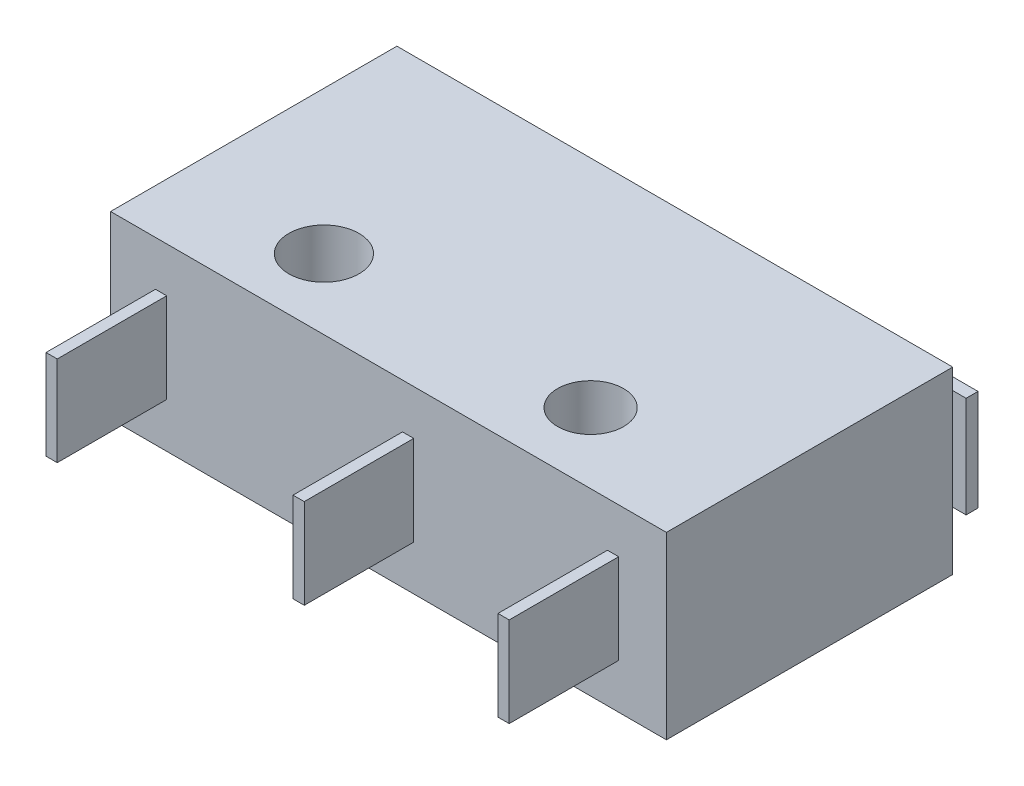
ISO-10303-21;
HEADER;
FILE_DESCRIPTION(('STEP AP214'),'2;1');
FILE_NAME('part.step','',(''),(''),'','','');
FILE_SCHEMA(('AUTOMOTIVE_DESIGN { 1 0 10303 214 1 1 1 1 }'));
ENDSEC;
DATA;
#1=APPLICATION_CONTEXT('core data for automotive mechanical design processes');
#2=APPLICATION_PROTOCOL_DEFINITION('international standard','automotive_design',2000,#1);
#3=PRODUCT_CONTEXT('',#1,'mechanical');
#4=PRODUCT('Part','Part','',(#3));
#5=PRODUCT_RELATED_PRODUCT_CATEGORY('part','',(#4));
#6=PRODUCT_DEFINITION_FORMATION('','',#4);
#7=PRODUCT_DEFINITION_CONTEXT('part definition',#1,'design');
#8=PRODUCT_DEFINITION('design','',#6,#7);
#9=PRODUCT_DEFINITION_SHAPE('','',#8);
#10=(LENGTH_UNIT() NAMED_UNIT(*) SI_UNIT(.MILLI.,.METRE.));
#11=(NAMED_UNIT(*) PLANE_ANGLE_UNIT() SI_UNIT($,.RADIAN.));
#12=(NAMED_UNIT(*) SI_UNIT($,.STERADIAN.) SOLID_ANGLE_UNIT());
#13=UNCERTAINTY_MEASURE_WITH_UNIT(LENGTH_MEASURE(1.E-05),#10,'distance_accuracy_value','');
#14=(GEOMETRIC_REPRESENTATION_CONTEXT(3) GLOBAL_UNCERTAINTY_ASSIGNED_CONTEXT((#13)) GLOBAL_UNIT_ASSIGNED_CONTEXT((#10,
#11,#12)) REPRESENTATION_CONTEXT('',''));
#15=CARTESIAN_POINT('',(0.,0.,0.));
#16=DIRECTION('',(0.,0.,1.));
#17=DIRECTION('',(1.,0.,0.));
#18=AXIS2_PLACEMENT_3D('',#15,#16,#17);
#19=CARTESIAN_POINT('',(-9.9,3.2,5.1));
#20=DIRECTION('',(0.,0.,-1.));
#21=DIRECTION('',(-1.,0.,0.));
#22=AXIS2_PLACEMENT_3D('',#19,#20,#21);
#23=PLANE('',#22);
#24=DIRECTION('',(0.,1.,0.));
#25=VECTOR('',#24,1.);
#26=CARTESIAN_POINT('',(0.9,1.6,5.1));
#27=LINE('',#26,#25);
#28=CARTESIAN_POINT('',(0.9,-1.6,5.1));
#29=VERTEX_POINT('',#28);
#30=CARTESIAN_POINT('',(0.9,1.6,5.1));
#31=VERTEX_POINT('',#30);
#32=EDGE_CURVE('E243',#29,#31,#27,.T.);
#33=ORIENTED_EDGE('',*,*,#32,.F.);
#34=DIRECTION('',(1.,0.,0.));
#35=VECTOR('',#34,1.);
#36=CARTESIAN_POINT('',(0.5,-1.6,5.1));
#37=LINE('',#36,#35);
#38=CARTESIAN_POINT('',(0.5,-1.6,5.1));
#39=VERTEX_POINT('',#38);
#40=EDGE_CURVE('E248',#39,#29,#37,.T.);
#41=ORIENTED_EDGE('',*,*,#40,.F.);
#42=DIRECTION('',(0.,-1.,0.));
#43=VECTOR('',#42,1.);
#44=CARTESIAN_POINT('',(0.5,1.6,5.1));
#45=LINE('',#44,#43);
#46=CARTESIAN_POINT('',(0.5,1.6,5.1));
#47=VERTEX_POINT('',#46);
#48=EDGE_CURVE('E260',#47,#39,#45,.T.);
#49=ORIENTED_EDGE('',*,*,#48,.F.);
#50=DIRECTION('',(-1.,0.,0.));
#51=VECTOR('',#50,1.);
#52=CARTESIAN_POINT('',(0.5,1.6,5.1));
#53=LINE('',#52,#51);
#54=EDGE_CURVE('E257',#31,#47,#53,.T.);
#55=ORIENTED_EDGE('',*,*,#54,.F.);
#56=EDGE_LOOP('',(#33,#41,#49,#55));
#57=FACE_BOUND('',#56,.T.);
#58=DIRECTION('',(1.,0.,0.));
#59=VECTOR('',#58,1.);
#60=CARTESIAN_POINT('',(-9.9,-3.2,5.1));
#61=LINE('',#60,#59);
#62=CARTESIAN_POINT('',(-9.9,-3.2,5.1));
#63=VERTEX_POINT('',#62);
#64=CARTESIAN_POINT('',(9.9,-3.2,5.1));
#65=VERTEX_POINT('',#64);
#66=EDGE_CURVE('E369',#63,#65,#61,.T.);
#67=ORIENTED_EDGE('',*,*,#66,.T.);
#68=DIRECTION('',(0.,-1.,0.));
#69=VECTOR('',#68,1.);
#70=CARTESIAN_POINT('',(9.9,3.2,5.1));
#71=LINE('',#70,#69);
#72=CARTESIAN_POINT('',(9.9,3.2,5.1));
#73=VERTEX_POINT('',#72);
#74=EDGE_CURVE('E375',#73,#65,#71,.T.);
#75=ORIENTED_EDGE('',*,*,#74,.F.);
#76=DIRECTION('',(1.,0.,0.));
#77=VECTOR('',#76,1.);
#78=CARTESIAN_POINT('',(-9.9,3.2,5.1));
#79=LINE('',#78,#77);
#80=CARTESIAN_POINT('',(-9.9,3.2,5.1));
#81=VERTEX_POINT('',#80);
#82=EDGE_CURVE('E373',#81,#73,#79,.T.);
#83=ORIENTED_EDGE('',*,*,#82,.F.);
#84=DIRECTION('',(0.,-1.,0.));
#85=VECTOR('',#84,1.);
#86=CARTESIAN_POINT('',(-9.9,3.2,5.1));
#87=LINE('',#86,#85);
#88=EDGE_CURVE('E385',#81,#63,#87,.T.);
#89=ORIENTED_EDGE('',*,*,#88,.T.);
#90=EDGE_LOOP('',(#67,#75,#83,#89));
#91=FACE_BOUND('',#90,.T.);
#92=DIRECTION('',(0.,1.,0.));
#93=VECTOR('',#92,1.);
#94=CARTESIAN_POINT('',(-7.9,1.6,5.1));
#95=LINE('',#94,#93);
#96=CARTESIAN_POINT('',(-7.9,-1.6,5.1));
#97=VERTEX_POINT('',#96);
#98=CARTESIAN_POINT('',(-7.9,1.6,5.1));
#99=VERTEX_POINT('',#98);
#100=EDGE_CURVE('E276',#97,#99,#95,.T.);
#101=ORIENTED_EDGE('',*,*,#100,.F.);
#102=DIRECTION('',(1.,0.,0.));
#103=VECTOR('',#102,1.);
#104=CARTESIAN_POINT('',(-8.3,-1.6,5.1));
#105=LINE('',#104,#103);
#106=CARTESIAN_POINT('',(-8.3,-1.6,5.1));
#107=VERTEX_POINT('',#106);
#108=EDGE_CURVE('E281',#107,#97,#105,.T.);
#109=ORIENTED_EDGE('',*,*,#108,.F.);
#110=DIRECTION('',(0.,-1.,0.));
#111=VECTOR('',#110,1.);
#112=CARTESIAN_POINT('',(-8.3,1.6,5.1));
#113=LINE('',#112,#111);
#114=CARTESIAN_POINT('',(-8.3,1.6,5.1));
#115=VERTEX_POINT('',#114);
#116=EDGE_CURVE('E293',#115,#107,#113,.T.);
#117=ORIENTED_EDGE('',*,*,#116,.F.);
#118=DIRECTION('',(-1.,0.,0.));
#119=VECTOR('',#118,1.);
#120=CARTESIAN_POINT('',(-8.3,1.6,5.1));
#121=LINE('',#120,#119);
#122=EDGE_CURVE('E290',#99,#115,#121,.T.);
#123=ORIENTED_EDGE('',*,*,#122,.F.);
#124=EDGE_LOOP('',(#101,#109,#117,#123));
#125=FACE_BOUND('',#124,.T.);
#126=DIRECTION('',(0.,1.,0.));
#127=VECTOR('',#126,1.);
#128=CARTESIAN_POINT('',(8.2,1.6,5.1));
#129=LINE('',#128,#127);
#130=CARTESIAN_POINT('',(8.2,-1.6,5.1));
#131=VERTEX_POINT('',#130);
#132=CARTESIAN_POINT('',(8.2,1.6,5.1));
#133=VERTEX_POINT('',#132);
#134=EDGE_CURVE('E208',#131,#133,#129,.T.);
#135=ORIENTED_EDGE('',*,*,#134,.F.);
#136=DIRECTION('',(1.,0.,0.));
#137=VECTOR('',#136,1.);
#138=CARTESIAN_POINT('',(7.8,-1.6,5.1));
#139=LINE('',#138,#137);
#140=CARTESIAN_POINT('',(7.8,-1.6,5.1));
#141=VERTEX_POINT('',#140);
#142=EDGE_CURVE('E215',#141,#131,#139,.T.);
#143=ORIENTED_EDGE('',*,*,#142,.F.);
#144=DIRECTION('',(0.,-1.,0.));
#145=VECTOR('',#144,1.);
#146=CARTESIAN_POINT('',(7.8,1.6,5.1));
#147=LINE('',#146,#145);
#148=CARTESIAN_POINT('',(7.8,1.6,5.1));
#149=VERTEX_POINT('',#148);
#150=EDGE_CURVE('E227',#149,#141,#147,.T.);
#151=ORIENTED_EDGE('',*,*,#150,.F.);
#152=DIRECTION('',(-1.,0.,0.));
#153=VECTOR('',#152,1.);
#154=CARTESIAN_POINT('',(7.8,1.6,5.1));
#155=LINE('',#154,#153);
#156=EDGE_CURVE('E224',#133,#149,#155,.T.);
#157=ORIENTED_EDGE('',*,*,#156,.F.);
#158=EDGE_LOOP('',(#135,#143,#151,#157));
#159=FACE_BOUND('',#158,.T.);
#160=ADVANCED_FACE('F37',(#57,#91,#125,#159),#23,.F.);
#161=CARTESIAN_POINT('',(-9.9,3.2,-5.1));
#162=DIRECTION('',(0.,0.,1.));
#163=DIRECTION('',(1.,0.,0.));
#164=AXIS2_PLACEMENT_3D('',#161,#162,#163);
#165=PLANE('',#164);
#166=DIRECTION('',(0.,-1.,0.));
#167=VECTOR('',#166,1.);
#168=CARTESIAN_POINT('',(-2.80029071826333,1.7,-5.1));
#169=LINE('',#168,#167);
#170=CARTESIAN_POINT('',(-2.80029071826333,1.7,-5.1));
#171=VERTEX_POINT('',#170);
#172=CARTESIAN_POINT('',(-2.80029071826333,-1.7,-5.1));
#173=VERTEX_POINT('',#172);
#174=EDGE_CURVE('E55',#171,#173,#169,.T.);
#175=ORIENTED_EDGE('',*,*,#174,.F.);
#176=DIRECTION('',(-1.,0.,0.));
#177=VECTOR('',#176,1.);
#178=CARTESIAN_POINT('',(-9.9,1.7,-5.1));
#179=LINE('',#178,#177);
#180=CARTESIAN_POINT('',(-3.81456377409336,1.7,-5.1));
#181=VERTEX_POINT('',#180);
#182=EDGE_CURVE('E11',#171,#181,#179,.T.);
#183=ORIENTED_EDGE('',*,*,#182,.T.);
#184=DIRECTION('',(0.,-1.,0.));
#185=VECTOR('',#184,1.);
#186=CARTESIAN_POINT('',(-3.81456377409336,1.7,-5.1));
#187=LINE('',#186,#185);
#188=CARTESIAN_POINT('',(-3.81456377409336,-1.7,-5.1));
#189=VERTEX_POINT('',#188);
#190=EDGE_CURVE('E45',#189,#181,#187,.F.);
#191=ORIENTED_EDGE('',*,*,#190,.F.);
#192=DIRECTION('',(-1.,0.,0.));
#193=VECTOR('',#192,1.);
#194=CARTESIAN_POINT('',(-9.9,-1.7,-5.1));
#195=LINE('',#194,#193);
#196=EDGE_CURVE('E194',#173,#189,#195,.T.);
#197=ORIENTED_EDGE('',*,*,#196,.F.);
#198=EDGE_LOOP('',(#175,#183,#191,#197));
#199=FACE_BOUND('',#198,.T.);
#200=DIRECTION('',(-1.,0.,0.));
#201=VECTOR('',#200,1.);
#202=CARTESIAN_POINT('',(-9.9,-3.2,-5.1));
#203=LINE('',#202,#201);
#204=CARTESIAN_POINT('',(9.9,-3.2,-5.1));
#205=VERTEX_POINT('',#204);
#206=CARTESIAN_POINT('',(-9.9,-3.2,-5.1));
#207=VERTEX_POINT('',#206);
#208=EDGE_CURVE('E378',#205,#207,#203,.T.);
#209=ORIENTED_EDGE('',*,*,#208,.T.);
#210=DIRECTION('',(0.,-1.,0.));
#211=VECTOR('',#210,1.);
#212=CARTESIAN_POINT('',(-9.9,3.2,-5.1));
#213=LINE('',#212,#211);
#214=CARTESIAN_POINT('',(-9.9,3.2,-5.1));
#215=VERTEX_POINT('',#214);
#216=EDGE_CURVE('E388',#215,#207,#213,.T.);
#217=ORIENTED_EDGE('',*,*,#216,.F.);
#218=DIRECTION('',(-1.,0.,0.));
#219=VECTOR('',#218,1.);
#220=CARTESIAN_POINT('',(-9.9,3.2,-5.1));
#221=LINE('',#220,#219);
#222=CARTESIAN_POINT('',(9.9,3.2,-5.1));
#223=VERTEX_POINT('',#222);
#224=EDGE_CURVE('E368',#223,#215,#221,.T.);
#225=ORIENTED_EDGE('',*,*,#224,.F.);
#226=DIRECTION('',(0.,-1.,0.));
#227=VECTOR('',#226,1.);
#228=CARTESIAN_POINT('',(9.9,3.2,-5.1));
#229=LINE('',#228,#227);
#230=EDGE_CURVE('E203',#223,#205,#229,.T.);
#231=ORIENTED_EDGE('',*,*,#230,.T.);
#232=EDGE_LOOP('',(#209,#217,#225,#231));
#233=FACE_BOUND('',#232,.T.);
#234=DIRECTION('',(1.,0.,0.));
#235=VECTOR('',#234,1.);
#236=CARTESIAN_POINT('',(-6.69422935085049,1.8,-5.1));
#237=LINE('',#236,#235);
#238=CARTESIAN_POINT('',(-7.3066351905182,1.8,-5.1));
#239=VERTEX_POINT('',#238);
#240=CARTESIAN_POINT('',(-6.69422935085049,1.8,-5.1));
#241=VERTEX_POINT('',#240);
#242=EDGE_CURVE('E310',#239,#241,#237,.T.);
#243=ORIENTED_EDGE('',*,*,#242,.F.);
#244=DIRECTION('',(0.,-1.,0.));
#245=VECTOR('',#244,1.);
#246=CARTESIAN_POINT('',(-7.3066351905182,1.8,-5.1));
#247=LINE('',#246,#245);
#248=CARTESIAN_POINT('',(-7.3066351905182,-1.8,-5.1));
#249=VERTEX_POINT('',#248);
#250=EDGE_CURVE('E324',#239,#249,#247,.T.);
#251=ORIENTED_EDGE('',*,*,#250,.T.);
#252=DIRECTION('',(1.,0.,0.));
#253=VECTOR('',#252,1.);
#254=CARTESIAN_POINT('',(-6.69422935085049,-1.8,-5.1));
#255=LINE('',#254,#253);
#256=CARTESIAN_POINT('',(-6.69422935085049,-1.8,-5.1));
#257=VERTEX_POINT('',#256);
#258=EDGE_CURVE('E309',#249,#257,#255,.T.);
#259=ORIENTED_EDGE('',*,*,#258,.T.);
#260=DIRECTION('',(0.,-1.,0.));
#261=VECTOR('',#260,1.);
#262=CARTESIAN_POINT('',(-6.69422935085049,1.8,-5.1));
#263=LINE('',#262,#261);
#264=EDGE_CURVE('E350',#241,#257,#263,.T.);
#265=ORIENTED_EDGE('',*,*,#264,.F.);
#266=EDGE_LOOP('',(#243,#251,#259,#265));
#267=FACE_BOUND('',#266,.T.);
#268=ADVANCED_FACE('F192',(#199,#233,#267),#165,.F.);
#269=CARTESIAN_POINT('',(9.9,3.2,5.1));
#270=DIRECTION('',(-1.,0.,0.));
#271=DIRECTION('',(0.,0.,1.));
#272=AXIS2_PLACEMENT_3D('',#269,#270,#271);
#273=PLANE('',#272);
#274=DIRECTION('',(0.,0.,-1.));
#275=VECTOR('',#274,1.);
#276=CARTESIAN_POINT('',(9.9,-3.2,5.1));
#277=LINE('',#276,#275);
#278=EDGE_CURVE('E360',#65,#205,#277,.T.);
#279=ORIENTED_EDGE('',*,*,#278,.T.);
#280=ORIENTED_EDGE('',*,*,#230,.F.);
#281=DIRECTION('',(0.,0.,-1.));
#282=VECTOR('',#281,1.);
#283=CARTESIAN_POINT('',(9.9,3.2,5.1));
#284=LINE('',#283,#282);
#285=EDGE_CURVE('E365',#73,#223,#284,.T.);
#286=ORIENTED_EDGE('',*,*,#285,.F.);
#287=ORIENTED_EDGE('',*,*,#74,.T.);
#288=EDGE_LOOP('',(#279,#280,#286,#287));
#289=FACE_BOUND('',#288,.T.);
#290=ADVANCED_FACE('F39',(#289),#273,.F.);
#291=CARTESIAN_POINT('',(-9.9,3.2,5.1));
#292=DIRECTION('',(1.,0.,0.));
#293=DIRECTION('',(0.,0.,-1.));
#294=AXIS2_PLACEMENT_3D('',#291,#292,#293);
#295=PLANE('',#294);
#296=DIRECTION('',(0.,0.,1.));
#297=VECTOR('',#296,1.);
#298=CARTESIAN_POINT('',(-9.9,-3.2,5.1));
#299=LINE('',#298,#297);
#300=EDGE_CURVE('E380',#207,#63,#299,.T.);
#301=ORIENTED_EDGE('',*,*,#300,.T.);
#302=ORIENTED_EDGE('',*,*,#88,.F.);
#303=DIRECTION('',(0.,0.,1.));
#304=VECTOR('',#303,1.);
#305=CARTESIAN_POINT('',(-9.9,3.2,5.1));
#306=LINE('',#305,#304);
#307=EDGE_CURVE('E371',#215,#81,#306,.T.);
#308=ORIENTED_EDGE('',*,*,#307,.F.);
#309=ORIENTED_EDGE('',*,*,#216,.T.);
#310=EDGE_LOOP('',(#301,#302,#308,#309));
#311=FACE_BOUND('',#310,.T.);
#312=ADVANCED_FACE('F406',(#311),#295,.F.);
#313=CARTESIAN_POINT('',(0.,3.2,0.));
#314=DIRECTION('',(0.,-1.,0.));
#315=DIRECTION('',(0.,0.,-1.));
#316=AXIS2_PLACEMENT_3D('',#313,#314,#315);
#317=PLANE('',#316);
#318=CARTESIAN_POINT('',(-4.8,3.2,2.6));
#319=DIRECTION('',(0.,1.,0.));
#320=DIRECTION('',(0.,0.,1.));
#321=AXIS2_PLACEMENT_3D('',#318,#319,#320);
#322=CIRCLE('',#321,1.25);
#323=CARTESIAN_POINT('',(-4.8,3.2,3.85));
#324=VERTEX_POINT('',#323);
#325=EDGE_CURVE('E353',#324,#324,#322,.T.);
#326=ORIENTED_EDGE('',*,*,#325,.F.);
#327=EDGE_LOOP('',(#326));
#328=FACE_BOUND('',#327,.T.);
#329=CARTESIAN_POINT('',(4.7,3.2,2.6));
#330=DIRECTION('',(0.,1.,0.));
#331=DIRECTION('',(0.,0.,1.));
#332=AXIS2_PLACEMENT_3D('',#329,#330,#331);
#333=CIRCLE('',#332,1.175);
#334=CARTESIAN_POINT('',(4.7,3.2,3.775));
#335=VERTEX_POINT('',#334);
#336=EDGE_CURVE('E352',#335,#335,#333,.T.);
#337=ORIENTED_EDGE('',*,*,#336,.F.);
#338=EDGE_LOOP('',(#337));
#339=FACE_BOUND('',#338,.T.);
#340=ORIENTED_EDGE('',*,*,#285,.T.);
#341=ORIENTED_EDGE('',*,*,#224,.T.);
#342=ORIENTED_EDGE('',*,*,#307,.T.);
#343=ORIENTED_EDGE('',*,*,#82,.T.);
#344=EDGE_LOOP('',(#340,#341,#342,#343));
#345=FACE_BOUND('',#344,.T.);
#346=ADVANCED_FACE('F412',(#328,#339,#345),#317,.F.);
#347=CARTESIAN_POINT('',(0.,-3.2,0.));
#348=DIRECTION('',(0.,-1.,0.));
#349=DIRECTION('',(0.,0.,-1.));
#350=AXIS2_PLACEMENT_3D('',#347,#348,#349);
#351=PLANE('',#350);
#352=CARTESIAN_POINT('',(-4.8,-3.2,2.6));
#353=DIRECTION('',(0.,1.,0.));
#354=DIRECTION('',(0.,0.,1.));
#355=AXIS2_PLACEMENT_3D('',#352,#353,#354);
#356=CIRCLE('',#355,1.25);
#357=CARTESIAN_POINT('',(-4.8,-3.2,3.85));
#358=VERTEX_POINT('',#357);
#359=EDGE_CURVE('E356',#358,#358,#356,.T.);
#360=ORIENTED_EDGE('',*,*,#359,.T.);
#361=EDGE_LOOP('',(#360));
#362=FACE_BOUND('',#361,.T.);
#363=CARTESIAN_POINT('',(4.7,-3.2,2.6));
#364=DIRECTION('',(0.,1.,0.));
#365=DIRECTION('',(0.,0.,1.));
#366=AXIS2_PLACEMENT_3D('',#363,#364,#365);
#367=CIRCLE('',#366,1.175);
#368=CARTESIAN_POINT('',(4.7,-3.2,3.775));
#369=VERTEX_POINT('',#368);
#370=EDGE_CURVE('E357',#369,#369,#367,.T.);
#371=ORIENTED_EDGE('',*,*,#370,.T.);
#372=EDGE_LOOP('',(#371));
#373=FACE_BOUND('',#372,.T.);
#374=ORIENTED_EDGE('',*,*,#278,.F.);
#375=ORIENTED_EDGE('',*,*,#66,.F.);
#376=ORIENTED_EDGE('',*,*,#300,.F.);
#377=ORIENTED_EDGE('',*,*,#208,.F.);
#378=EDGE_LOOP('',(#374,#375,#376,#377));
#379=FACE_BOUND('',#378,.T.);
#380=ADVANCED_FACE('F402',(#362,#373,#379),#351,.T.);
#381=CARTESIAN_POINT('',(4.7,-3.2,2.6));
#382=DIRECTION('',(0.,1.,0.));
#383=DIRECTION('',(0.,0.,1.));
#384=AXIS2_PLACEMENT_3D('',#381,#382,#383);
#385=CYLINDRICAL_SURFACE('',#384,1.175);
#386=ORIENTED_EDGE('',*,*,#370,.F.);
#387=EDGE_LOOP('',(#386));
#388=FACE_BOUND('',#387,.T.);
#389=ORIENTED_EDGE('',*,*,#336,.T.);
#390=EDGE_LOOP('',(#389));
#391=FACE_BOUND('',#390,.T.);
#392=ADVANCED_FACE('F420',(#388,#391),#385,.F.);
#393=CARTESIAN_POINT('',(-4.8,-3.2,2.6));
#394=DIRECTION('',(0.,1.,0.));
#395=DIRECTION('',(0.,0.,1.));
#396=AXIS2_PLACEMENT_3D('',#393,#394,#395);
#397=CYLINDRICAL_SURFACE('',#396,1.25);
#398=ORIENTED_EDGE('',*,*,#359,.F.);
#399=EDGE_LOOP('',(#398));
#400=FACE_BOUND('',#399,.T.);
#401=ORIENTED_EDGE('',*,*,#325,.T.);
#402=EDGE_LOOP('',(#401));
#403=FACE_BOUND('',#402,.T.);
#404=ADVANCED_FACE('F507',(#400,#403),#397,.F.);
#405=CARTESIAN_POINT('',(-6.69422935085049,1.8,-5.77562059134893));
#406=DIRECTION('',(-1.,0.,0.));
#407=DIRECTION('',(0.,0.,1.));
#408=AXIS2_PLACEMENT_3D('',#405,#406,#407);
#409=PLANE('',#408);
#410=DIRECTION('',(0.,0.,-1.));
#411=VECTOR('',#410,1.);
#412=CARTESIAN_POINT('',(-6.69422935085049,-1.8,-5.77562059134893));
#413=LINE('',#412,#411);
#414=CARTESIAN_POINT('',(-6.69422935085049,-1.8,-5.77562059134893));
#415=VERTEX_POINT('',#414);
#416=EDGE_CURVE('E327',#257,#415,#413,.T.);
#417=ORIENTED_EDGE('',*,*,#416,.T.);
#418=DIRECTION('',(0.,-1.,0.));
#419=VECTOR('',#418,1.);
#420=CARTESIAN_POINT('',(-6.69422935085049,1.8,-5.77562059134893));
#421=LINE('',#420,#419);
#422=CARTESIAN_POINT('',(-6.69422935085049,1.8,-5.77562059134893));
#423=VERTEX_POINT('',#422);
#424=EDGE_CURVE('E347',#423,#415,#421,.T.);
#425=ORIENTED_EDGE('',*,*,#424,.F.);
#426=DIRECTION('',(0.,0.,-1.));
#427=VECTOR('',#426,1.);
#428=CARTESIAN_POINT('',(-6.69422935085049,1.8,-5.77562059134893));
#429=LINE('',#428,#427);
#430=EDGE_CURVE('E313',#241,#423,#429,.T.);
#431=ORIENTED_EDGE('',*,*,#430,.F.);
#432=ORIENTED_EDGE('',*,*,#264,.T.);
#433=EDGE_LOOP('',(#417,#425,#431,#432));
#434=FACE_BOUND('',#433,.T.);
#435=ADVANCED_FACE('F503',(#434),#409,.F.);
#436=CARTESIAN_POINT('',(9.7,1.8,-5.77562059134893));
#437=DIRECTION('',(0.,0.,-1.));
#438=DIRECTION('',(-1.,0.,0.));
#439=AXIS2_PLACEMENT_3D('',#436,#437,#438);
#440=PLANE('',#439);
#441=DIRECTION('',(1.,0.,0.));
#442=VECTOR('',#441,1.);
#443=CARTESIAN_POINT('',(9.7,-1.8,-5.77562059134893));
#444=LINE('',#443,#442);
#445=CARTESIAN_POINT('',(9.7,-1.8,-5.77562059134893));
#446=VERTEX_POINT('',#445);
#447=EDGE_CURVE('E329',#415,#446,#444,.T.);
#448=ORIENTED_EDGE('',*,*,#447,.T.);
#449=DIRECTION('',(0.,-1.,0.));
#450=VECTOR('',#449,1.);
#451=CARTESIAN_POINT('',(9.7,1.8,-5.77562059134893));
#452=LINE('',#451,#450);
#453=CARTESIAN_POINT('',(9.7,1.8,-5.77562059134893));
#454=VERTEX_POINT('',#453);
#455=EDGE_CURVE('E344',#454,#446,#452,.T.);
#456=ORIENTED_EDGE('',*,*,#455,.F.);
#457=DIRECTION('',(1.,0.,0.));
#458=VECTOR('',#457,1.);
#459=CARTESIAN_POINT('',(9.7,1.8,-5.77562059134893));
#460=LINE('',#459,#458);
#461=EDGE_CURVE('E316',#423,#454,#460,.T.);
#462=ORIENTED_EDGE('',*,*,#461,.F.);
#463=ORIENTED_EDGE('',*,*,#424,.T.);
#464=EDGE_LOOP('',(#448,#456,#462,#463));
#465=FACE_BOUND('',#464,.T.);
#466=ADVANCED_FACE('F499',(#465),#440,.F.);
#467=CARTESIAN_POINT('',(9.7,1.8,-6.2));
#468=DIRECTION('',(-1.,0.,0.));
#469=DIRECTION('',(0.,0.,1.));
#470=AXIS2_PLACEMENT_3D('',#467,#468,#469);
#471=PLANE('',#470);
#472=DIRECTION('',(0.,0.,-1.));
#473=VECTOR('',#472,1.);
#474=CARTESIAN_POINT('',(9.7,-1.8,-6.2));
#475=LINE('',#474,#473);
#476=CARTESIAN_POINT('',(9.7,-1.8,-6.2));
#477=VERTEX_POINT('',#476);
#478=EDGE_CURVE('E331',#446,#477,#475,.T.);
#479=ORIENTED_EDGE('',*,*,#478,.T.);
#480=DIRECTION('',(0.,-1.,0.));
#481=VECTOR('',#480,1.);
#482=CARTESIAN_POINT('',(9.7,1.8,-6.2));
#483=LINE('',#482,#481);
#484=CARTESIAN_POINT('',(9.7,1.8,-6.2));
#485=VERTEX_POINT('',#484);
#486=EDGE_CURVE('E341',#485,#477,#483,.T.);
#487=ORIENTED_EDGE('',*,*,#486,.F.);
#488=DIRECTION('',(0.,0.,-1.));
#489=VECTOR('',#488,1.);
#490=CARTESIAN_POINT('',(9.7,1.8,-6.2));
#491=LINE('',#490,#489);
#492=EDGE_CURVE('E318',#454,#485,#491,.T.);
#493=ORIENTED_EDGE('',*,*,#492,.F.);
#494=ORIENTED_EDGE('',*,*,#455,.T.);
#495=EDGE_LOOP('',(#479,#487,#493,#494));
#496=FACE_BOUND('',#495,.T.);
#497=ADVANCED_FACE('F495',(#496),#471,.F.);
#498=CARTESIAN_POINT('',(-7.3066351905182,1.8,-6.2));
#499=DIRECTION('',(0.,0.,1.));
#500=DIRECTION('',(1.,0.,0.));
#501=AXIS2_PLACEMENT_3D('',#498,#499,#500);
#502=PLANE('',#501);
#503=DIRECTION('',(-1.,0.,0.));
#504=VECTOR('',#503,1.);
#505=CARTESIAN_POINT('',(-7.3066351905182,-1.8,-6.2));
#506=LINE('',#505,#504);
#507=CARTESIAN_POINT('',(-7.3066351905182,-1.8,-6.2));
#508=VERTEX_POINT('',#507);
#509=EDGE_CURVE('E333',#477,#508,#506,.T.);
#510=ORIENTED_EDGE('',*,*,#509,.T.);
#511=DIRECTION('',(0.,-1.,0.));
#512=VECTOR('',#511,1.);
#513=CARTESIAN_POINT('',(-7.3066351905182,1.8,-6.2));
#514=LINE('',#513,#512);
#515=CARTESIAN_POINT('',(-7.3066351905182,1.8,-6.2));
#516=VERTEX_POINT('',#515);
#517=EDGE_CURVE('E338',#516,#508,#514,.T.);
#518=ORIENTED_EDGE('',*,*,#517,.F.);
#519=DIRECTION('',(-1.,0.,0.));
#520=VECTOR('',#519,1.);
#521=CARTESIAN_POINT('',(-7.3066351905182,1.8,-6.2));
#522=LINE('',#521,#520);
#523=EDGE_CURVE('E320',#485,#516,#522,.T.);
#524=ORIENTED_EDGE('',*,*,#523,.F.);
#525=ORIENTED_EDGE('',*,*,#486,.T.);
#526=EDGE_LOOP('',(#510,#518,#524,#525));
#527=FACE_BOUND('',#526,.T.);
#528=ADVANCED_FACE('F491',(#527),#502,.F.);
#529=CARTESIAN_POINT('',(-7.3066351905182,1.8,-5.1));
#530=DIRECTION('',(1.,0.,0.));
#531=DIRECTION('',(0.,0.,-1.));
#532=AXIS2_PLACEMENT_3D('',#529,#530,#531);
#533=PLANE('',#532);
#534=DIRECTION('',(0.,0.,1.));
#535=VECTOR('',#534,1.);
#536=CARTESIAN_POINT('',(-7.3066351905182,-1.8,-5.1));
#537=LINE('',#536,#535);
#538=EDGE_CURVE('E314',#508,#249,#537,.T.);
#539=ORIENTED_EDGE('',*,*,#538,.T.);
#540=ORIENTED_EDGE('',*,*,#250,.F.);
#541=DIRECTION('',(0.,0.,1.));
#542=VECTOR('',#541,1.);
#543=CARTESIAN_POINT('',(-7.3066351905182,1.8,-5.1));
#544=LINE('',#543,#542);
#545=EDGE_CURVE('E322',#516,#239,#544,.T.);
#546=ORIENTED_EDGE('',*,*,#545,.F.);
#547=ORIENTED_EDGE('',*,*,#517,.T.);
#548=EDGE_LOOP('',(#539,#540,#546,#547));
#549=FACE_BOUND('',#548,.T.);
#550=ADVANCED_FACE('F484',(#549),#533,.F.);
#551=CARTESIAN_POINT('',(0.,1.8,0.));
#552=DIRECTION('',(0.,-1.,0.));
#553=DIRECTION('',(0.,0.,-1.));
#554=AXIS2_PLACEMENT_3D('',#551,#552,#553);
#555=PLANE('',#554);
#556=ORIENTED_EDGE('',*,*,#242,.T.);
#557=ORIENTED_EDGE('',*,*,#430,.T.);
#558=ORIENTED_EDGE('',*,*,#461,.T.);
#559=ORIENTED_EDGE('',*,*,#492,.T.);
#560=ORIENTED_EDGE('',*,*,#523,.T.);
#561=ORIENTED_EDGE('',*,*,#545,.T.);
#562=EDGE_LOOP('',(#556,#557,#558,#559,#560,#561));
#563=FACE_BOUND('',#562,.T.);
#564=ADVANCED_FACE('F481',(#563),#555,.F.);
#565=CARTESIAN_POINT('',(0.,-1.8,0.));
#566=DIRECTION('',(0.,-1.,0.));
#567=DIRECTION('',(0.,0.,-1.));
#568=AXIS2_PLACEMENT_3D('',#565,#566,#567);
#569=PLANE('',#568);
#570=ORIENTED_EDGE('',*,*,#258,.F.);
#571=ORIENTED_EDGE('',*,*,#538,.F.);
#572=ORIENTED_EDGE('',*,*,#509,.F.);
#573=ORIENTED_EDGE('',*,*,#478,.F.);
#574=ORIENTED_EDGE('',*,*,#447,.F.);
#575=ORIENTED_EDGE('',*,*,#416,.F.);
#576=EDGE_LOOP('',(#570,#571,#572,#573,#574,#575));
#577=FACE_BOUND('',#576,.T.);
#578=ADVANCED_FACE('F479',(#577),#569,.T.);
#579=CARTESIAN_POINT('',(-7.9,1.6,9.));
#580=DIRECTION('',(-1.,0.,0.));
#581=DIRECTION('',(0.,0.,1.));
#582=AXIS2_PLACEMENT_3D('',#579,#580,#581);
#583=PLANE('',#582);
#584=ORIENTED_EDGE('',*,*,#100,.T.);
#585=DIRECTION('',(0.,0.,-1.));
#586=VECTOR('',#585,1.);
#587=CARTESIAN_POINT('',(-7.9,1.6,9.));
#588=LINE('',#587,#586);
#589=CARTESIAN_POINT('',(-7.9,1.6,9.));
#590=VERTEX_POINT('',#589);
#591=EDGE_CURVE('E306',#590,#99,#588,.T.);
#592=ORIENTED_EDGE('',*,*,#591,.F.);
#593=DIRECTION('',(0.,1.,0.));
#594=VECTOR('',#593,1.);
#595=CARTESIAN_POINT('',(-7.9,1.6,9.));
#596=LINE('',#595,#594);
#597=CARTESIAN_POINT('',(-7.9,-1.6,9.));
#598=VERTEX_POINT('',#597);
#599=EDGE_CURVE('E277',#598,#590,#596,.T.);
#600=ORIENTED_EDGE('',*,*,#599,.F.);
#601=DIRECTION('',(0.,0.,-1.));
#602=VECTOR('',#601,1.);
#603=CARTESIAN_POINT('',(-7.9,-1.6,9.));
#604=LINE('',#603,#602);
#605=EDGE_CURVE('E287',#598,#97,#604,.T.);
#606=ORIENTED_EDGE('',*,*,#605,.T.);
#607=EDGE_LOOP('',(#584,#592,#600,#606));
#608=FACE_BOUND('',#607,.T.);
#609=ADVANCED_FACE('F475',(#608),#583,.F.);
#610=CARTESIAN_POINT('',(-8.3,1.6,9.));
#611=DIRECTION('',(0.,-1.,0.));
#612=DIRECTION('',(0.,0.,-1.));
#613=AXIS2_PLACEMENT_3D('',#610,#611,#612);
#614=PLANE('',#613);
#615=ORIENTED_EDGE('',*,*,#122,.T.);
#616=DIRECTION('',(0.,0.,-1.));
#617=VECTOR('',#616,1.);
#618=CARTESIAN_POINT('',(-8.3,1.6,9.));
#619=LINE('',#618,#617);
#620=CARTESIAN_POINT('',(-8.3,1.6,9.));
#621=VERTEX_POINT('',#620);
#622=EDGE_CURVE('E303',#621,#115,#619,.T.);
#623=ORIENTED_EDGE('',*,*,#622,.F.);
#624=DIRECTION('',(-1.,0.,0.));
#625=VECTOR('',#624,1.);
#626=CARTESIAN_POINT('',(-8.3,1.6,9.));
#627=LINE('',#626,#625);
#628=EDGE_CURVE('E280',#590,#621,#627,.T.);
#629=ORIENTED_EDGE('',*,*,#628,.F.);
#630=ORIENTED_EDGE('',*,*,#591,.T.);
#631=EDGE_LOOP('',(#615,#623,#629,#630));
#632=FACE_BOUND('',#631,.T.);
#633=ADVANCED_FACE('F471',(#632),#614,.F.);
#634=CARTESIAN_POINT('',(-8.3,1.6,9.));
#635=DIRECTION('',(1.,0.,0.));
#636=DIRECTION('',(0.,0.,-1.));
#637=AXIS2_PLACEMENT_3D('',#634,#635,#636);
#638=PLANE('',#637);
#639=ORIENTED_EDGE('',*,*,#116,.T.);
#640=DIRECTION('',(0.,0.,-1.));
#641=VECTOR('',#640,1.);
#642=CARTESIAN_POINT('',(-8.3,-1.6,9.));
#643=LINE('',#642,#641);
#644=CARTESIAN_POINT('',(-8.3,-1.6,9.));
#645=VERTEX_POINT('',#644);
#646=EDGE_CURVE('E300',#645,#107,#643,.T.);
#647=ORIENTED_EDGE('',*,*,#646,.F.);
#648=DIRECTION('',(0.,-1.,0.));
#649=VECTOR('',#648,1.);
#650=CARTESIAN_POINT('',(-8.3,1.6,9.));
#651=LINE('',#650,#649);
#652=EDGE_CURVE('E283',#621,#645,#651,.T.);
#653=ORIENTED_EDGE('',*,*,#652,.F.);
#654=ORIENTED_EDGE('',*,*,#622,.T.);
#655=EDGE_LOOP('',(#639,#647,#653,#654));
#656=FACE_BOUND('',#655,.T.);
#657=ADVANCED_FACE('F467',(#656),#638,.F.);
#658=CARTESIAN_POINT('',(-8.3,-1.6,9.));
#659=DIRECTION('',(0.,1.,0.));
#660=DIRECTION('',(0.,0.,1.));
#661=AXIS2_PLACEMENT_3D('',#658,#659,#660);
#662=PLANE('',#661);
#663=ORIENTED_EDGE('',*,*,#108,.T.);
#664=ORIENTED_EDGE('',*,*,#605,.F.);
#665=DIRECTION('',(1.,0.,0.));
#666=VECTOR('',#665,1.);
#667=CARTESIAN_POINT('',(-8.3,-1.6,9.));
#668=LINE('',#667,#666);
#669=EDGE_CURVE('E285',#645,#598,#668,.T.);
#670=ORIENTED_EDGE('',*,*,#669,.F.);
#671=ORIENTED_EDGE('',*,*,#646,.T.);
#672=EDGE_LOOP('',(#663,#664,#670,#671));
#673=FACE_BOUND('',#672,.T.);
#674=ADVANCED_FACE('F463',(#673),#662,.F.);
#675=CARTESIAN_POINT('',(0.,0.,9.));
#676=DIRECTION('',(0.,0.,1.));
#677=DIRECTION('',(1.,0.,0.));
#678=AXIS2_PLACEMENT_3D('',#675,#676,#677);
#679=PLANE('',#678);
#680=ORIENTED_EDGE('',*,*,#599,.T.);
#681=ORIENTED_EDGE('',*,*,#628,.T.);
#682=ORIENTED_EDGE('',*,*,#652,.T.);
#683=ORIENTED_EDGE('',*,*,#669,.T.);
#684=EDGE_LOOP('',(#680,#681,#682,#683));
#685=FACE_BOUND('',#684,.T.);
#686=ADVANCED_FACE('F457',(#685),#679,.T.);
#687=CARTESIAN_POINT('',(0.9,1.6,9.));
#688=DIRECTION('',(-1.,0.,0.));
#689=DIRECTION('',(0.,0.,1.));
#690=AXIS2_PLACEMENT_3D('',#687,#688,#689);
#691=PLANE('',#690);
#692=ORIENTED_EDGE('',*,*,#32,.T.);
#693=DIRECTION('',(0.,0.,-1.));
#694=VECTOR('',#693,1.);
#695=CARTESIAN_POINT('',(0.9,1.6,9.));
#696=LINE('',#695,#694);
#697=CARTESIAN_POINT('',(0.9,1.6,9.));
#698=VERTEX_POINT('',#697);
#699=EDGE_CURVE('E273',#698,#31,#696,.T.);
#700=ORIENTED_EDGE('',*,*,#699,.F.);
#701=DIRECTION('',(0.,1.,0.));
#702=VECTOR('',#701,1.);
#703=CARTESIAN_POINT('',(0.9,1.6,9.));
#704=LINE('',#703,#702);
#705=CARTESIAN_POINT('',(0.9,-1.6,9.));
#706=VERTEX_POINT('',#705);
#707=EDGE_CURVE('E244',#706,#698,#704,.T.);
#708=ORIENTED_EDGE('',*,*,#707,.F.);
#709=DIRECTION('',(0.,0.,-1.));
#710=VECTOR('',#709,1.);
#711=CARTESIAN_POINT('',(0.9,-1.6,9.));
#712=LINE('',#711,#710);
#713=EDGE_CURVE('E254',#706,#29,#712,.T.);
#714=ORIENTED_EDGE('',*,*,#713,.T.);
#715=EDGE_LOOP('',(#692,#700,#708,#714));
#716=FACE_BOUND('',#715,.T.);
#717=ADVANCED_FACE('F441',(#716),#691,.F.);
#718=CARTESIAN_POINT('',(0.5,1.6,9.));
#719=DIRECTION('',(0.,-1.,0.));
#720=DIRECTION('',(0.,0.,-1.));
#721=AXIS2_PLACEMENT_3D('',#718,#719,#720);
#722=PLANE('',#721);
#723=ORIENTED_EDGE('',*,*,#54,.T.);
#724=DIRECTION('',(0.,0.,-1.));
#725=VECTOR('',#724,1.);
#726=CARTESIAN_POINT('',(0.5,1.6,9.));
#727=LINE('',#726,#725);
#728=CARTESIAN_POINT('',(0.5,1.6,9.));
#729=VERTEX_POINT('',#728);
#730=EDGE_CURVE('E270',#729,#47,#727,.T.);
#731=ORIENTED_EDGE('',*,*,#730,.F.);
#732=DIRECTION('',(-1.,0.,0.));
#733=VECTOR('',#732,1.);
#734=CARTESIAN_POINT('',(0.5,1.6,9.));
#735=LINE('',#734,#733);
#736=EDGE_CURVE('E247',#698,#729,#735,.T.);
#737=ORIENTED_EDGE('',*,*,#736,.F.);
#738=ORIENTED_EDGE('',*,*,#699,.T.);
#739=EDGE_LOOP('',(#723,#731,#737,#738));
#740=FACE_BOUND('',#739,.T.);
#741=ADVANCED_FACE('F449',(#740),#722,.F.);
#742=CARTESIAN_POINT('',(0.5,1.6,9.));
#743=DIRECTION('',(1.,0.,0.));
#744=DIRECTION('',(0.,0.,-1.));
#745=AXIS2_PLACEMENT_3D('',#742,#743,#744);
#746=PLANE('',#745);
#747=ORIENTED_EDGE('',*,*,#48,.T.);
#748=DIRECTION('',(0.,0.,-1.));
#749=VECTOR('',#748,1.);
#750=CARTESIAN_POINT('',(0.5,-1.6,9.));
#751=LINE('',#750,#749);
#752=CARTESIAN_POINT('',(0.5,-1.6,9.));
#753=VERTEX_POINT('',#752);
#754=EDGE_CURVE('E267',#753,#39,#751,.T.);
#755=ORIENTED_EDGE('',*,*,#754,.F.);
#756=DIRECTION('',(0.,-1.,0.));
#757=VECTOR('',#756,1.);
#758=CARTESIAN_POINT('',(0.5,1.6,9.));
#759=LINE('',#758,#757);
#760=EDGE_CURVE('E250',#729,#753,#759,.T.);
#761=ORIENTED_EDGE('',*,*,#760,.F.);
#762=ORIENTED_EDGE('',*,*,#730,.T.);
#763=EDGE_LOOP('',(#747,#755,#761,#762));
#764=FACE_BOUND('',#763,.T.);
#765=ADVANCED_FACE('F447',(#764),#746,.F.);
#766=CARTESIAN_POINT('',(0.5,-1.6,9.));
#767=DIRECTION('',(0.,1.,0.));
#768=DIRECTION('',(0.,0.,1.));
#769=AXIS2_PLACEMENT_3D('',#766,#767,#768);
#770=PLANE('',#769);
#771=ORIENTED_EDGE('',*,*,#40,.T.);
#772=ORIENTED_EDGE('',*,*,#713,.F.);
#773=DIRECTION('',(1.,0.,0.));
#774=VECTOR('',#773,1.);
#775=CARTESIAN_POINT('',(0.5,-1.6,9.));
#776=LINE('',#775,#774);
#777=EDGE_CURVE('E252',#753,#706,#776,.T.);
#778=ORIENTED_EDGE('',*,*,#777,.F.);
#779=ORIENTED_EDGE('',*,*,#754,.T.);
#780=EDGE_LOOP('',(#771,#772,#778,#779));
#781=FACE_BOUND('',#780,.T.);
#782=ADVANCED_FACE('F437',(#781),#770,.F.);
#783=CARTESIAN_POINT('',(8.8,0.,9.));
#784=DIRECTION('',(0.,0.,1.));
#785=DIRECTION('',(1.,0.,0.));
#786=AXIS2_PLACEMENT_3D('',#783,#784,#785);
#787=PLANE('',#786);
#788=ORIENTED_EDGE('',*,*,#707,.T.);
#789=ORIENTED_EDGE('',*,*,#736,.T.);
#790=ORIENTED_EDGE('',*,*,#760,.T.);
#791=ORIENTED_EDGE('',*,*,#777,.T.);
#792=EDGE_LOOP('',(#788,#789,#790,#791));
#793=FACE_BOUND('',#792,.T.);
#794=ADVANCED_FACE('F443',(#793),#787,.T.);
#795=CARTESIAN_POINT('',(8.2,1.6,9.));
#796=DIRECTION('',(-1.,0.,0.));
#797=DIRECTION('',(0.,0.,1.));
#798=AXIS2_PLACEMENT_3D('',#795,#796,#797);
#799=PLANE('',#798);
#800=ORIENTED_EDGE('',*,*,#134,.T.);
#801=DIRECTION('',(0.,0.,-1.));
#802=VECTOR('',#801,1.);
#803=CARTESIAN_POINT('',(8.2,1.6,9.));
#804=LINE('',#803,#802);
#805=CARTESIAN_POINT('',(8.2,1.6,9.));
#806=VERTEX_POINT('',#805);
#807=EDGE_CURVE('E240',#806,#133,#804,.T.);
#808=ORIENTED_EDGE('',*,*,#807,.F.);
#809=DIRECTION('',(0.,1.,0.));
#810=VECTOR('',#809,1.);
#811=CARTESIAN_POINT('',(8.2,1.6,9.));
#812=LINE('',#811,#810);
#813=CARTESIAN_POINT('',(8.2,-1.6,9.));
#814=VERTEX_POINT('',#813);
#815=EDGE_CURVE('E211',#814,#806,#812,.T.);
#816=ORIENTED_EDGE('',*,*,#815,.F.);
#817=DIRECTION('',(0.,0.,-1.));
#818=VECTOR('',#817,1.);
#819=CARTESIAN_POINT('',(8.2,-1.6,9.));
#820=LINE('',#819,#818);
#821=EDGE_CURVE('E221',#814,#131,#820,.T.);
#822=ORIENTED_EDGE('',*,*,#821,.T.);
#823=EDGE_LOOP('',(#800,#808,#816,#822));
#824=FACE_BOUND('',#823,.T.);
#825=ADVANCED_FACE('F622',(#824),#799,.F.);
#826=CARTESIAN_POINT('',(7.8,1.6,9.));
#827=DIRECTION('',(0.,-1.,0.));
#828=DIRECTION('',(0.,0.,-1.));
#829=AXIS2_PLACEMENT_3D('',#826,#827,#828);
#830=PLANE('',#829);
#831=ORIENTED_EDGE('',*,*,#156,.T.);
#832=DIRECTION('',(0.,0.,-1.));
#833=VECTOR('',#832,1.);
#834=CARTESIAN_POINT('',(7.8,1.6,9.));
#835=LINE('',#834,#833);
#836=CARTESIAN_POINT('',(7.8,1.6,9.));
#837=VERTEX_POINT('',#836);
#838=EDGE_CURVE('E237',#837,#149,#835,.T.);
#839=ORIENTED_EDGE('',*,*,#838,.F.);
#840=DIRECTION('',(-1.,0.,0.));
#841=VECTOR('',#840,1.);
#842=CARTESIAN_POINT('',(7.8,1.6,9.));
#843=LINE('',#842,#841);
#844=EDGE_CURVE('E214',#806,#837,#843,.T.);
#845=ORIENTED_EDGE('',*,*,#844,.F.);
#846=ORIENTED_EDGE('',*,*,#807,.T.);
#847=EDGE_LOOP('',(#831,#839,#845,#846));
#848=FACE_BOUND('',#847,.T.);
#849=ADVANCED_FACE('F612',(#848),#830,.F.);
#850=CARTESIAN_POINT('',(7.8,1.6,9.));
#851=DIRECTION('',(1.,0.,0.));
#852=DIRECTION('',(0.,0.,-1.));
#853=AXIS2_PLACEMENT_3D('',#850,#851,#852);
#854=PLANE('',#853);
#855=ORIENTED_EDGE('',*,*,#150,.T.);
#856=DIRECTION('',(0.,0.,-1.));
#857=VECTOR('',#856,1.);
#858=CARTESIAN_POINT('',(7.8,-1.6,9.));
#859=LINE('',#858,#857);
#860=CARTESIAN_POINT('',(7.8,-1.6,9.));
#861=VERTEX_POINT('',#860);
#862=EDGE_CURVE('E234',#861,#141,#859,.T.);
#863=ORIENTED_EDGE('',*,*,#862,.F.);
#864=DIRECTION('',(0.,-1.,0.));
#865=VECTOR('',#864,1.);
#866=CARTESIAN_POINT('',(7.8,1.6,9.));
#867=LINE('',#866,#865);
#868=EDGE_CURVE('E217',#837,#861,#867,.T.);
#869=ORIENTED_EDGE('',*,*,#868,.F.);
#870=ORIENTED_EDGE('',*,*,#838,.T.);
#871=EDGE_LOOP('',(#855,#863,#869,#870));
#872=FACE_BOUND('',#871,.T.);
#873=ADVANCED_FACE('F602',(#872),#854,.F.);
#874=CARTESIAN_POINT('',(7.8,-1.6,9.));
#875=DIRECTION('',(0.,1.,0.));
#876=DIRECTION('',(0.,0.,1.));
#877=AXIS2_PLACEMENT_3D('',#874,#875,#876);
#878=PLANE('',#877);
#879=ORIENTED_EDGE('',*,*,#142,.T.);
#880=ORIENTED_EDGE('',*,*,#821,.F.);
#881=DIRECTION('',(1.,0.,0.));
#882=VECTOR('',#881,1.);
#883=CARTESIAN_POINT('',(7.8,-1.6,9.));
#884=LINE('',#883,#882);
#885=EDGE_CURVE('E219',#861,#814,#884,.T.);
#886=ORIENTED_EDGE('',*,*,#885,.F.);
#887=ORIENTED_EDGE('',*,*,#862,.T.);
#888=EDGE_LOOP('',(#879,#880,#886,#887));
#889=FACE_BOUND('',#888,.T.);
#890=ADVANCED_FACE('F590',(#889),#878,.F.);
#891=CARTESIAN_POINT('',(16.1,0.,9.));
#892=DIRECTION('',(0.,0.,1.));
#893=DIRECTION('',(1.,0.,0.));
#894=AXIS2_PLACEMENT_3D('',#891,#892,#893);
#895=PLANE('',#894);
#896=ORIENTED_EDGE('',*,*,#815,.T.);
#897=ORIENTED_EDGE('',*,*,#844,.T.);
#898=ORIENTED_EDGE('',*,*,#868,.T.);
#899=ORIENTED_EDGE('',*,*,#885,.T.);
#900=EDGE_LOOP('',(#896,#897,#898,#899));
#901=FACE_BOUND('',#900,.T.);
#902=ADVANCED_FACE('F585',(#901),#895,.T.);
#903=CARTESIAN_POINT('',(-3.30742724617835,1.7,-5.1));
#904=DIRECTION('',(0.,-1.,0.));
#905=DIRECTION('',(0.,0.,-1.));
#906=AXIS2_PLACEMENT_3D('',#903,#904,#905);
#907=CYLINDRICAL_SURFACE('',#906,0.507136527915017);
#908=CARTESIAN_POINT('',(-3.30742724617835,-1.7,-5.1));
#909=DIRECTION('',(0.,1.,0.));
#910=DIRECTION('',(0.,0.,1.));
#911=AXIS2_PLACEMENT_3D('',#908,#909,#910);
#912=CIRCLE('',#911,0.507136527915017);
#913=EDGE_CURVE('E202',#173,#189,#912,.T.);
#914=ORIENTED_EDGE('',*,*,#913,.T.);
#915=ORIENTED_EDGE('',*,*,#190,.T.);
#916=CARTESIAN_POINT('',(-3.30742724617835,1.7,-5.1));
#917=DIRECTION('',(0.,1.,0.));
#918=DIRECTION('',(0.,0.,1.));
#919=AXIS2_PLACEMENT_3D('',#916,#917,#918);
#920=CIRCLE('',#919,0.507136527915017);
#921=EDGE_CURVE('E206',#171,#181,#920,.T.);
#922=ORIENTED_EDGE('',*,*,#921,.F.);
#923=ORIENTED_EDGE('',*,*,#174,.T.);
#924=EDGE_LOOP('',(#914,#915,#922,#923));
#925=FACE_BOUND('',#924,.T.);
#926=ADVANCED_FACE('F205',(#925),#907,.T.);
#927=CARTESIAN_POINT('',(-3.30742724617835,1.7,-5.1));
#928=DIRECTION('',(0.,1.,0.));
#929=DIRECTION('',(0.,0.,1.));
#930=AXIS2_PLACEMENT_3D('',#927,#928,#929);
#931=PLANE('',#930);
#932=ORIENTED_EDGE('',*,*,#182,.F.);
#933=ORIENTED_EDGE('',*,*,#921,.T.);
#934=EDGE_LOOP('',(#932,#933));
#935=FACE_BOUND('',#934,.T.);
#936=ADVANCED_FACE('F718',(#935),#931,.T.);
#937=CARTESIAN_POINT('',(-3.30742724617835,-1.7,-5.1));
#938=DIRECTION('',(0.,1.,0.));
#939=DIRECTION('',(0.,0.,1.));
#940=AXIS2_PLACEMENT_3D('',#937,#938,#939);
#941=PLANE('',#940);
#942=ORIENTED_EDGE('',*,*,#913,.F.);
#943=ORIENTED_EDGE('',*,*,#196,.T.);
#944=EDGE_LOOP('',(#942,#943));
#945=FACE_BOUND('',#944,.T.);
#946=ADVANCED_FACE('F201',(#945),#941,.F.);
#947=CLOSED_SHELL('',(#160,#268,#290,#312,#346,#380,#392,#404,#435,#466,#497,#528,#550,#564,
#578,#609,#633,#657,#674,#686,#717,#741,#765,#782,#794,#825,#849,#873,#890,#902,#926,#936,#946));
#948=MANIFOLD_SOLID_BREP('B2',#947);
#949=ADVANCED_BREP_SHAPE_REPRESENTATION('',(#18,#948),#14);
#950=SHAPE_DEFINITION_REPRESENTATION(#9,#949);
ENDSEC;
END-ISO-10303-21;
